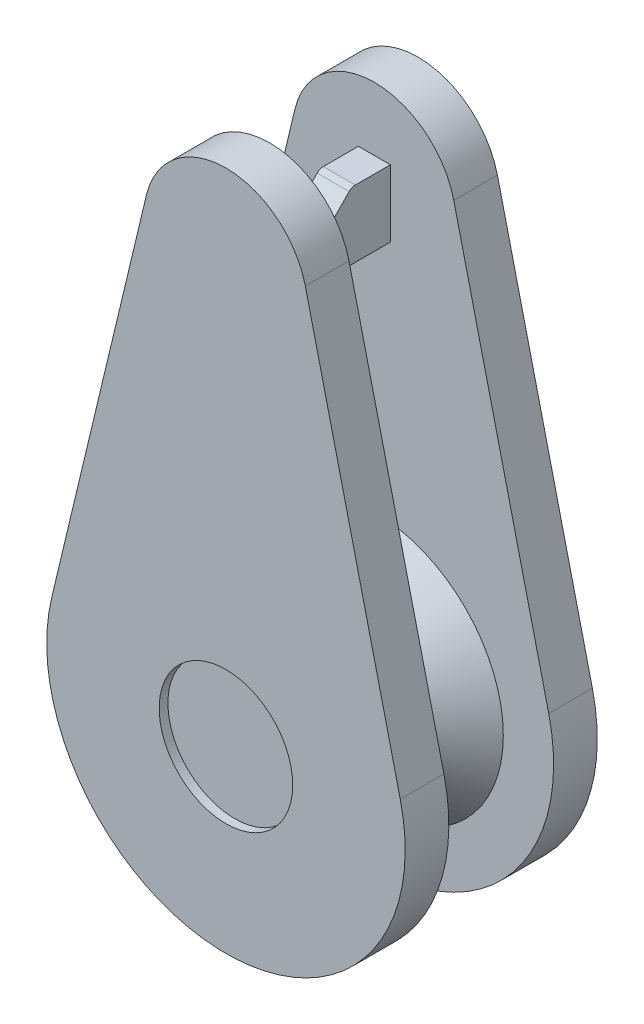
ISO-10303-21;
HEADER;
FILE_DESCRIPTION(('STEP AP214'),'2;1');
FILE_NAME('part.step','',(''),(''),'','','');
FILE_SCHEMA(('AUTOMOTIVE_DESIGN { 1 0 10303 214 1 1 1 1 }'));
ENDSEC;
DATA;
#1=APPLICATION_CONTEXT('core data for automotive mechanical design processes');
#2=APPLICATION_PROTOCOL_DEFINITION('international standard','automotive_design',2000,#1);
#3=PRODUCT_CONTEXT('',#1,'mechanical');
#4=PRODUCT('Part','Part','',(#3));
#5=PRODUCT_RELATED_PRODUCT_CATEGORY('part','',(#4));
#6=PRODUCT_DEFINITION_FORMATION('','',#4);
#7=PRODUCT_DEFINITION_CONTEXT('part definition',#1,'design');
#8=PRODUCT_DEFINITION('design','',#6,#7);
#9=PRODUCT_DEFINITION_SHAPE('','',#8);
#10=(LENGTH_UNIT() NAMED_UNIT(*) SI_UNIT(.MILLI.,.METRE.));
#11=(NAMED_UNIT(*) PLANE_ANGLE_UNIT() SI_UNIT($,.RADIAN.));
#12=(NAMED_UNIT(*) SI_UNIT($,.STERADIAN.) SOLID_ANGLE_UNIT());
#13=UNCERTAINTY_MEASURE_WITH_UNIT(LENGTH_MEASURE(1.E-05),#10,'distance_accuracy_value','');
#14=(GEOMETRIC_REPRESENTATION_CONTEXT(3) GLOBAL_UNCERTAINTY_ASSIGNED_CONTEXT((#13)) GLOBAL_UNIT_ASSIGNED_CONTEXT((#10,
#11,#12)) REPRESENTATION_CONTEXT('',''));
#15=CARTESIAN_POINT('',(0.,0.,0.));
#16=DIRECTION('',(0.,0.,1.));
#17=DIRECTION('',(1.,0.,0.));
#18=AXIS2_PLACEMENT_3D('',#15,#16,#17);
#19=CARTESIAN_POINT('',(24.5,136.000000000001,1.));
#20=DIRECTION('',(0.,0.,1.));
#21=DIRECTION('',(1.,0.,0.));
#22=AXIS2_PLACEMENT_3D('',#19,#20,#21);
#23=PLANE('',#22);
#24=CARTESIAN_POINT('',(24.5,136.000000000001,1.));
#25=DIRECTION('',(0.,0.,1.));
#26=DIRECTION('',(1.,0.,0.));
#27=AXIS2_PLACEMENT_3D('',#24,#25,#26);
#28=CIRCLE('',#27,4.10494291795747);
#29=CARTESIAN_POINT('',(20.5076953119614,136.955018134674,1.));
#30=VERTEX_POINT('',#29);
#31=CARTESIAN_POINT('',(28.4923043974712,136.955019349345,1.));
#32=VERTEX_POINT('',#31);
#33=EDGE_CURVE('E271',#30,#32,#28,.T.);
#34=ORIENTED_EDGE('',*,*,#33,.T.);
#35=DIRECTION('',(-0.232651066879886,0.972560271180995,0.));
#36=VECTOR('',#35,1.);
#37=CARTESIAN_POINT('',(26.3178255819127,146.045077413118,1.));
#38=LINE('',#37,#36);
#39=CARTESIAN_POINT('',(26.3178255819127,146.045077413118,1.));
#40=VERTEX_POINT('',#39);
#41=EDGE_CURVE('E274',#32,#40,#38,.T.);
#42=ORIENTED_EDGE('',*,*,#41,.T.);
#43=CARTESIAN_POINT('',(24.5,145.606873612069,1.));
#44=DIRECTION('',(0.,0.,1.));
#45=DIRECTION('',(-1.,0.,0.));
#46=AXIS2_PLACEMENT_3D('',#43,#44,#45);
#47=CIRCLE('',#46,1.86989636544635);
#48=CARTESIAN_POINT('',(22.681412951381,146.041906443135,1.));
#49=VERTEX_POINT('',#48);
#50=EDGE_CURVE('E277',#40,#49,#47,.T.);
#51=ORIENTED_EDGE('',*,*,#50,.T.);
#52=DIRECTION('',(-0.232650770975412,-0.972560341965755,0.));
#53=VECTOR('',#52,1.);
#54=CARTESIAN_POINT('',(20.5076953119614,136.955018134674,1.));
#55=LINE('',#54,#53);
#56=EDGE_CURVE('E279',#49,#30,#55,.T.);
#57=ORIENTED_EDGE('',*,*,#56,.T.);
#58=EDGE_LOOP('',(#34,#42,#51,#57));
#59=FACE_BOUND('',#58,.T.);
#60=CARTESIAN_POINT('',(24.5,136.000000000001,1.));
#61=DIRECTION('',(0.,0.,1.));
#62=DIRECTION('',(1.,0.,0.));
#63=AXIS2_PLACEMENT_3D('',#60,#61,#62);
#64=CIRCLE('',#63,2.95273846712997);
#65=CARTESIAN_POINT('',(27.45273846713,136.000000000001,1.));
#66=VERTEX_POINT('',#65);
#67=EDGE_CURVE('E267',#66,#66,#64,.T.);
#68=ORIENTED_EDGE('',*,*,#67,.F.);
#69=EDGE_LOOP('',(#68));
#70=FACE_BOUND('',#69,.T.);
#71=DIRECTION('',(-1.,0.,0.));
#72=VECTOR('',#71,1.);
#73=CARTESIAN_POINT('',(24.1333720619488,146.024420810161,1.));
#74=LINE('',#73,#72);
#75=CARTESIAN_POINT('',(24.8666279380512,146.024420810161,1.));
#76=VERTEX_POINT('',#75);
#77=CARTESIAN_POINT('',(24.1333720619488,146.024420810161,1.));
#78=VERTEX_POINT('',#77);
#79=EDGE_CURVE('E250',#76,#78,#74,.T.);
#80=ORIENTED_EDGE('',*,*,#79,.F.);
#81=DIRECTION('',(0.,1.,0.));
#82=VECTOR('',#81,1.);
#83=CARTESIAN_POINT('',(24.8666279380512,146.024420810161,1.));
#84=LINE('',#83,#82);
#85=CARTESIAN_POINT('',(24.8666279380512,144.490732446669,1.));
#86=VERTEX_POINT('',#85);
#87=EDGE_CURVE('E247',#86,#76,#84,.T.);
#88=ORIENTED_EDGE('',*,*,#87,.F.);
#89=DIRECTION('',(1.,0.,0.));
#90=VECTOR('',#89,1.);
#91=CARTESIAN_POINT('',(24.1333720619488,144.490732446669,1.));
#92=LINE('',#91,#90);
#93=CARTESIAN_POINT('',(24.1333720619488,144.490732446669,1.));
#94=VERTEX_POINT('',#93);
#95=EDGE_CURVE('E256',#94,#86,#92,.T.);
#96=ORIENTED_EDGE('',*,*,#95,.F.);
#97=DIRECTION('',(0.,-1.,0.));
#98=VECTOR('',#97,1.);
#99=CARTESIAN_POINT('',(24.1333720619488,146.024420810161,1.));
#100=LINE('',#99,#98);
#101=EDGE_CURVE('E253',#78,#94,#100,.T.);
#102=ORIENTED_EDGE('',*,*,#101,.F.);
#103=EDGE_LOOP('',(#80,#88,#96,#102));
#104=FACE_BOUND('',#103,.T.);
#105=ADVANCED_FACE('F40',(#59,#70,#104),#23,.T.);
#106=CARTESIAN_POINT('',(24.5,136.000000000001,1.));
#107=DIRECTION('',(0.,0.,-1.));
#108=DIRECTION('',(-1.,0.,0.));
#109=AXIS2_PLACEMENT_3D('',#106,#107,#108);
#110=CYLINDRICAL_SURFACE('',#109,4.10494291795747);
#111=CARTESIAN_POINT('',(24.5,136.000000000001,0.));
#112=DIRECTION('',(0.,0.,1.));
#113=DIRECTION('',(1.,0.,0.));
#114=AXIS2_PLACEMENT_3D('',#111,#112,#113);
#115=CIRCLE('',#114,4.10494291795747);
#116=CARTESIAN_POINT('',(20.5076953119614,136.955018134674,0.));
#117=VERTEX_POINT('',#116);
#118=CARTESIAN_POINT('',(28.4923043974712,136.955019349345,0.));
#119=VERTEX_POINT('',#118);
#120=EDGE_CURVE('E270',#117,#119,#115,.T.);
#121=ORIENTED_EDGE('',*,*,#120,.T.);
#122=DIRECTION('',(0.,0.,-1.));
#123=VECTOR('',#122,1.);
#124=CARTESIAN_POINT('',(28.4923043974712,136.955019349345,1.));
#125=LINE('',#124,#123);
#126=EDGE_CURVE('E297',#32,#119,#125,.T.);
#127=ORIENTED_EDGE('',*,*,#126,.F.);
#128=ORIENTED_EDGE('',*,*,#33,.F.);
#129=DIRECTION('',(0.,0.,-1.));
#130=VECTOR('',#129,1.);
#131=CARTESIAN_POINT('',(20.5076953119614,136.955018134674,1.));
#132=LINE('',#131,#130);
#133=EDGE_CURVE('E281',#30,#117,#132,.T.);
#134=ORIENTED_EDGE('',*,*,#133,.T.);
#135=EDGE_LOOP('',(#121,#127,#128,#134));
#136=FACE_BOUND('',#135,.T.);
#137=ADVANCED_FACE('F330',(#136),#110,.T.);
#138=CARTESIAN_POINT('',(26.3178255819127,146.045077413118,1.));
#139=DIRECTION('',(-0.972560271180995,-0.232651066879886,0.));
#140=DIRECTION('',(0.232651066879886,-0.972560271180995,0.));
#141=AXIS2_PLACEMENT_3D('',#138,#139,#140);
#142=PLANE('',#141);
#143=DIRECTION('',(-0.232651066879886,0.972560271180995,0.));
#144=VECTOR('',#143,1.);
#145=CARTESIAN_POINT('',(26.3178255819127,146.045077413118,0.));
#146=LINE('',#145,#144);
#147=CARTESIAN_POINT('',(26.3178255819127,146.045077413118,0.));
#148=VERTEX_POINT('',#147);
#149=EDGE_CURVE('E284',#119,#148,#146,.T.);
#150=ORIENTED_EDGE('',*,*,#149,.T.);
#151=DIRECTION('',(0.,0.,-1.));
#152=VECTOR('',#151,1.);
#153=CARTESIAN_POINT('',(26.3178255819127,146.045077413118,1.));
#154=LINE('',#153,#152);
#155=EDGE_CURVE('E294',#40,#148,#154,.T.);
#156=ORIENTED_EDGE('',*,*,#155,.F.);
#157=ORIENTED_EDGE('',*,*,#41,.F.);
#158=ORIENTED_EDGE('',*,*,#126,.T.);
#159=EDGE_LOOP('',(#150,#156,#157,#158));
#160=FACE_BOUND('',#159,.T.);
#161=ADVANCED_FACE('F336',(#160),#142,.F.);
#162=CARTESIAN_POINT('',(24.5,145.606873612069,1.));
#163=DIRECTION('',(0.,0.,-1.));
#164=DIRECTION('',(-1.,0.,0.));
#165=AXIS2_PLACEMENT_3D('',#162,#163,#164);
#166=CYLINDRICAL_SURFACE('',#165,1.86989636544635);
#167=CARTESIAN_POINT('',(24.5,145.606873612069,0.));
#168=DIRECTION('',(0.,0.,1.));
#169=DIRECTION('',(-1.,0.,0.));
#170=AXIS2_PLACEMENT_3D('',#167,#168,#169);
#171=CIRCLE('',#170,1.86989636544635);
#172=CARTESIAN_POINT('',(22.681412951381,146.041906443135,0.));
#173=VERTEX_POINT('',#172);
#174=EDGE_CURVE('E286',#148,#173,#171,.T.);
#175=ORIENTED_EDGE('',*,*,#174,.T.);
#176=DIRECTION('',(0.,0.,-1.));
#177=VECTOR('',#176,1.);
#178=CARTESIAN_POINT('',(22.681412951381,146.041906443135,1.));
#179=LINE('',#178,#177);
#180=EDGE_CURVE('E291',#49,#173,#179,.T.);
#181=ORIENTED_EDGE('',*,*,#180,.F.);
#182=ORIENTED_EDGE('',*,*,#50,.F.);
#183=ORIENTED_EDGE('',*,*,#155,.T.);
#184=EDGE_LOOP('',(#175,#181,#182,#183));
#185=FACE_BOUND('',#184,.T.);
#186=ADVANCED_FACE('F350',(#185),#166,.T.);
#187=CARTESIAN_POINT('',(20.5076953119614,136.955018134674,1.));
#188=DIRECTION('',(0.972560341965755,-0.232650770975412,0.));
#189=DIRECTION('',(0.232650770975412,0.972560341965755,0.));
#190=AXIS2_PLACEMENT_3D('',#187,#188,#189);
#191=PLANE('',#190);
#192=DIRECTION('',(-0.232650770975412,-0.972560341965755,0.));
#193=VECTOR('',#192,1.);
#194=CARTESIAN_POINT('',(20.5076953119614,136.955018134674,0.));
#195=LINE('',#194,#193);
#196=EDGE_CURVE('E275',#173,#117,#195,.T.);
#197=ORIENTED_EDGE('',*,*,#196,.T.);
#198=ORIENTED_EDGE('',*,*,#133,.F.);
#199=ORIENTED_EDGE('',*,*,#56,.F.);
#200=ORIENTED_EDGE('',*,*,#180,.T.);
#201=EDGE_LOOP('',(#197,#198,#199,#200));
#202=FACE_BOUND('',#201,.T.);
#203=ADVANCED_FACE('F346',(#202),#191,.F.);
#204=CARTESIAN_POINT('',(24.5,136.000000000001,0.));
#205=DIRECTION('',(0.,0.,1.));
#206=DIRECTION('',(1.,0.,0.));
#207=AXIS2_PLACEMENT_3D('',#204,#205,#206);
#208=PLANE('',#207);
#209=ORIENTED_EDGE('',*,*,#120,.F.);
#210=ORIENTED_EDGE('',*,*,#196,.F.);
#211=ORIENTED_EDGE('',*,*,#174,.F.);
#212=ORIENTED_EDGE('',*,*,#149,.F.);
#213=EDGE_LOOP('',(#209,#210,#211,#212));
#214=FACE_BOUND('',#213,.T.);
#215=ADVANCED_FACE('F343',(#214),#208,.F.);
#216=CARTESIAN_POINT('',(24.5,136.000000000001,2.2));
#217=DIRECTION('',(0.,0.,-1.));
#218=DIRECTION('',(-1.,0.,0.));
#219=AXIS2_PLACEMENT_3D('',#216,#217,#218);
#220=CONICAL_SURFACE('',#219,1.73815260557396,0.791438820048917);
#221=CARTESIAN_POINT('',(24.5,136.000000000001,2.05772695129359));
#222=DIRECTION('',(0.,0.,-1.));
#223=DIRECTION('',(-1.,0.,0.));
#224=AXIS2_PLACEMENT_3D('',#221,#222,#223);
#225=CIRCLE('',#224,1.88215496677335);
#226=CARTESIAN_POINT('',(22.6178450332266,136.000000000001,2.05772695129359));
#227=VERTEX_POINT('',#226);
#228=EDGE_CURVE('E48',#227,#227,#225,.T.);
#229=ORIENTED_EDGE('',*,*,#228,.T.);
#230=EDGE_LOOP('',(#229));
#231=FACE_BOUND('',#230,.T.);
#232=ORIENTED_EDGE('',*,*,#67,.T.);
#233=EDGE_LOOP('',(#232));
#234=FACE_BOUND('',#233,.T.);
#235=ADVANCED_FACE('F318',(#231,#234),#220,.T.);
#236=CARTESIAN_POINT('',(24.8666279380512,146.024420810161,3.4));
#237=DIRECTION('',(-1.,0.,0.));
#238=DIRECTION('',(0.,0.,1.));
#239=AXIS2_PLACEMENT_3D('',#236,#237,#238);
#240=PLANE('',#239);
#241=DIRECTION('',(0.,0.,-1.));
#242=VECTOR('',#241,1.);
#243=CARTESIAN_POINT('',(24.8666279380512,146.024420810161,3.4));
#244=LINE('',#243,#242);
#245=CARTESIAN_POINT('',(24.8666279380512,146.024420810161,1.80116368583087));
#246=VERTEX_POINT('',#245);
#247=EDGE_CURVE('E265',#246,#76,#244,.T.);
#248=ORIENTED_EDGE('',*,*,#247,.F.);
#249=CARTESIAN_POINT('',(24.8666279380512,145.824420810161,1.80116368583087));
#250=DIRECTION('',(-1.,0.,0.));
#251=DIRECTION('',(0.,0.,1.));
#252=AXIS2_PLACEMENT_3D('',#249,#250,#251);
#253=CIRCLE('',#252,0.2);
#254=CARTESIAN_POINT('',(24.8666279380512,145.964986025553,1.94343603107641));
#255=VERTEX_POINT('',#254);
#256=EDGE_CURVE('E312',#246,#255,#253,.F.);
#257=ORIENTED_EDGE('',*,*,#256,.T.);
#258=DIRECTION('',(0.,-0.711361726227743,0.702826076962349));
#259=VECTOR('',#258,1.);
#260=CARTESIAN_POINT('',(24.8666279380512,145.266833213032,2.63321168845735));
#261=LINE('',#260,#259);
#262=CARTESIAN_POINT('',(24.8666279380512,144.831297662062,3.0635212361601));
#263=VERTEX_POINT('',#262);
#264=EDGE_CURVE('E245',#255,#263,#261,.T.);
#265=ORIENTED_EDGE('',*,*,#264,.T.);
#266=CARTESIAN_POINT('',(24.8666279380512,144.690732446669,2.92124889091455));
#267=DIRECTION('',(-1.,0.,0.));
#268=DIRECTION('',(0.,0.,1.));
#269=AXIS2_PLACEMENT_3D('',#266,#267,#268);
#270=CIRCLE('',#269,0.2);
#271=CARTESIAN_POINT('',(24.8666279380512,144.490732446669,2.92124889091455));
#272=VERTEX_POINT('',#271);
#273=EDGE_CURVE('E55',#263,#272,#270,.F.);
#274=ORIENTED_EDGE('',*,*,#273,.T.);
#275=DIRECTION('',(0.,0.,-1.));
#276=VECTOR('',#275,1.);
#277=CARTESIAN_POINT('',(24.8666279380512,144.490732446669,3.4));
#278=LINE('',#277,#276);
#279=EDGE_CURVE('E259',#272,#86,#278,.T.);
#280=ORIENTED_EDGE('',*,*,#279,.T.);
#281=ORIENTED_EDGE('',*,*,#87,.T.);
#282=EDGE_LOOP('',(#248,#257,#265,#274,#280,#281));
#283=FACE_BOUND('',#282,.T.);
#284=ADVANCED_FACE('F384',(#283),#240,.F.);
#285=CARTESIAN_POINT('',(24.1333720619488,146.024420810161,3.4));
#286=DIRECTION('',(0.,-1.,0.));
#287=DIRECTION('',(0.,0.,-1.));
#288=AXIS2_PLACEMENT_3D('',#285,#286,#287);
#289=PLANE('',#288);
#290=DIRECTION('',(0.,0.,-1.));
#291=VECTOR('',#290,1.);
#292=CARTESIAN_POINT('',(24.1333720619488,146.024420810161,3.4));
#293=LINE('',#292,#291);
#294=CARTESIAN_POINT('',(24.1333720619488,146.024420810161,1.80116368583087));
#295=VERTEX_POINT('',#294);
#296=EDGE_CURVE('E263',#295,#78,#293,.T.);
#297=ORIENTED_EDGE('',*,*,#296,.F.);
#298=DIRECTION('',(-1.,0.,0.));
#299=VECTOR('',#298,1.);
#300=CARTESIAN_POINT('',(24.1333720619488,146.024420810161,1.80116368583087));
#301=LINE('',#300,#299);
#302=EDGE_CURVE('E63',#295,#246,#301,.F.);
#303=ORIENTED_EDGE('',*,*,#302,.T.);
#304=ORIENTED_EDGE('',*,*,#247,.T.);
#305=ORIENTED_EDGE('',*,*,#79,.T.);
#306=EDGE_LOOP('',(#297,#303,#304,#305));
#307=FACE_BOUND('',#306,.T.);
#308=ADVANCED_FACE('F376',(#307),#289,.F.);
#309=CARTESIAN_POINT('',(24.1333720619488,146.024420810161,3.4));
#310=DIRECTION('',(1.,0.,0.));
#311=DIRECTION('',(0.,0.,-1.));
#312=AXIS2_PLACEMENT_3D('',#309,#310,#311);
#313=PLANE('',#312);
#314=DIRECTION('',(0.,-0.711361726227743,0.702826076962349));
#315=VECTOR('',#314,1.);
#316=CARTESIAN_POINT('',(24.1333720619488,146.024420810161,1.88471440611308));
#317=LINE('',#316,#315);
#318=CARTESIAN_POINT('',(24.1333720619488,145.964986025553,1.94343603107642));
#319=VERTEX_POINT('',#318);
#320=CARTESIAN_POINT('',(24.1333720619488,144.831297662062,3.0635212361601));
#321=VERTEX_POINT('',#320);
#322=EDGE_CURVE('E240',#319,#321,#317,.T.);
#323=ORIENTED_EDGE('',*,*,#322,.F.);
#324=CARTESIAN_POINT('',(24.1333720619488,145.824420810161,1.80116368583087));
#325=DIRECTION('',(1.,0.,0.));
#326=DIRECTION('',(0.,0.,-1.));
#327=AXIS2_PLACEMENT_3D('',#324,#325,#326);
#328=CIRCLE('',#327,0.2);
#329=EDGE_CURVE('E308',#319,#295,#328,.F.);
#330=ORIENTED_EDGE('',*,*,#329,.T.);
#331=ORIENTED_EDGE('',*,*,#296,.T.);
#332=ORIENTED_EDGE('',*,*,#101,.T.);
#333=DIRECTION('',(0.,0.,-1.));
#334=VECTOR('',#333,1.);
#335=CARTESIAN_POINT('',(24.1333720619488,144.490732446669,3.4));
#336=LINE('',#335,#334);
#337=CARTESIAN_POINT('',(24.1333720619488,144.490732446669,2.92124889091455));
#338=VERTEX_POINT('',#337);
#339=EDGE_CURVE('E261',#338,#94,#336,.T.);
#340=ORIENTED_EDGE('',*,*,#339,.F.);
#341=CARTESIAN_POINT('',(24.1333720619488,144.690732446669,2.92124889091455));
#342=DIRECTION('',(1.,0.,0.));
#343=DIRECTION('',(0.,0.,-1.));
#344=AXIS2_PLACEMENT_3D('',#341,#342,#343);
#345=CIRCLE('',#344,0.2);
#346=EDGE_CURVE('E306',#338,#321,#345,.F.);
#347=ORIENTED_EDGE('',*,*,#346,.T.);
#348=EDGE_LOOP('',(#323,#330,#331,#332,#340,#347));
#349=FACE_BOUND('',#348,.T.);
#350=ADVANCED_FACE('F371',(#349),#313,.F.);
#351=CARTESIAN_POINT('',(24.1333720619488,144.490732446669,3.4));
#352=DIRECTION('',(0.,1.,0.));
#353=DIRECTION('',(0.,0.,1.));
#354=AXIS2_PLACEMENT_3D('',#351,#352,#353);
#355=PLANE('',#354);
#356=ORIENTED_EDGE('',*,*,#279,.F.);
#357=DIRECTION('',(1.,0.,0.));
#358=VECTOR('',#357,1.);
#359=CARTESIAN_POINT('',(24.1333720619488,144.490732446669,2.92124889091455));
#360=LINE('',#359,#358);
#361=EDGE_CURVE('E314',#272,#338,#360,.F.);
#362=ORIENTED_EDGE('',*,*,#361,.T.);
#363=ORIENTED_EDGE('',*,*,#339,.T.);
#364=ORIENTED_EDGE('',*,*,#95,.T.);
#365=EDGE_LOOP('',(#356,#362,#363,#364));
#366=FACE_BOUND('',#365,.T.);
#367=ADVANCED_FACE('F383',(#366),#355,.F.);
#368=CARTESIAN_POINT('',(26.5333720619488,146.024420810161,1.88471440611308));
#369=DIRECTION('',(0.,-0.702826076962349,-0.711361726227743));
#370=DIRECTION('',(0.,0.711361726227743,-0.702826076962349));
#371=AXIS2_PLACEMENT_3D('',#368,#369,#370);
#372=PLANE('',#371);
#373=ORIENTED_EDGE('',*,*,#264,.F.);
#374=DIRECTION('',(-1.,0.,0.));
#375=VECTOR('',#374,1.);
#376=CARTESIAN_POINT('',(26.5333720619488,145.964986025553,1.94343603107642));
#377=LINE('',#376,#375);
#378=EDGE_CURVE('E303',#255,#319,#377,.T.);
#379=ORIENTED_EDGE('',*,*,#378,.T.);
#380=ORIENTED_EDGE('',*,*,#322,.T.);
#381=DIRECTION('',(1.,0.,0.));
#382=VECTOR('',#381,1.);
#383=CARTESIAN_POINT('',(26.5333720619488,144.831297662062,3.0635212361601));
#384=LINE('',#383,#382);
#385=EDGE_CURVE('E300',#321,#263,#384,.T.);
#386=ORIENTED_EDGE('',*,*,#385,.T.);
#387=EDGE_LOOP('',(#373,#379,#380,#386));
#388=FACE_BOUND('',#387,.T.);
#389=ADVANCED_FACE('F229',(#388),#372,.F.);
#390=CARTESIAN_POINT('',(26.5333720619488,145.824420810161,1.80116368583087));
#391=DIRECTION('',(-1.,0.,0.));
#392=DIRECTION('',(0.,0.,1.));
#393=AXIS2_PLACEMENT_3D('',#390,#391,#392);
#394=CYLINDRICAL_SURFACE('',#393,0.2);
#395=ORIENTED_EDGE('',*,*,#256,.F.);
#396=ORIENTED_EDGE('',*,*,#302,.F.);
#397=ORIENTED_EDGE('',*,*,#329,.F.);
#398=ORIENTED_EDGE('',*,*,#378,.F.);
#399=EDGE_LOOP('',(#395,#396,#397,#398));
#400=FACE_BOUND('',#399,.T.);
#401=ADVANCED_FACE('F358',(#400),#394,.T.);
#402=CARTESIAN_POINT('',(26.5333720619488,144.690732446669,2.92124889091455));
#403=DIRECTION('',(1.,0.,0.));
#404=DIRECTION('',(0.,0.,-1.));
#405=AXIS2_PLACEMENT_3D('',#402,#403,#404);
#406=CYLINDRICAL_SURFACE('',#405,0.2);
#407=ORIENTED_EDGE('',*,*,#346,.F.);
#408=ORIENTED_EDGE('',*,*,#361,.F.);
#409=ORIENTED_EDGE('',*,*,#273,.F.);
#410=ORIENTED_EDGE('',*,*,#385,.F.);
#411=EDGE_LOOP('',(#407,#408,#409,#410));
#412=FACE_BOUND('',#411,.T.);
#413=ADVANCED_FACE('F227',(#412),#406,.T.);
#414=CARTESIAN_POINT('',(24.5,136.000000000001,2.2));
#415=DIRECTION('',(0.,0.,1.));
#416=DIRECTION('',(-1.,0.,0.));
#417=AXIS2_PLACEMENT_3D('',#414,#415,#416);
#418=CONICAL_SURFACE('',#417,1.73815260557396,0.791438820048917);
#419=CARTESIAN_POINT('',(24.5,136.000000000001,2.34227304870641));
#420=DIRECTION('',(0.,0.,1.));
#421=DIRECTION('',(1.,0.,0.));
#422=AXIS2_PLACEMENT_3D('',#419,#420,#421);
#423=CIRCLE('',#422,1.88215496677335);
#424=CARTESIAN_POINT('',(26.3821549667733,136.000000000001,2.34227304870641));
#425=VERTEX_POINT('',#424);
#426=EDGE_CURVE('E12',#425,#425,#423,.T.);
#427=ORIENTED_EDGE('',*,*,#426,.T.);
#428=EDGE_LOOP('',(#427));
#429=FACE_BOUND('',#428,.T.);
#430=CARTESIAN_POINT('',(24.5,136.000000000001,3.4));
#431=DIRECTION('',(0.,0.,1.));
#432=DIRECTION('',(1.,0.,0.));
#433=AXIS2_PLACEMENT_3D('',#430,#431,#432);
#434=CIRCLE('',#433,2.95273846712997);
#435=CARTESIAN_POINT('',(27.45273846713,136.000000000001,3.4));
#436=VERTEX_POINT('',#435);
#437=EDGE_CURVE('E153',#436,#436,#434,.T.);
#438=ORIENTED_EDGE('',*,*,#437,.F.);
#439=EDGE_LOOP('',(#438));
#440=FACE_BOUND('',#439,.T.);
#441=ADVANCED_FACE('F223',(#429,#440),#418,.T.);
#442=CARTESIAN_POINT('',(24.5,136.000000000001,3.4));
#443=DIRECTION('',(0.,0.,1.));
#444=DIRECTION('',(1.,0.,0.));
#445=AXIS2_PLACEMENT_3D('',#442,#443,#444);
#446=CYLINDRICAL_SURFACE('',#445,4.10494291795747);
#447=CARTESIAN_POINT('',(24.5,136.000000000001,4.4));
#448=DIRECTION('',(0.,0.,1.));
#449=DIRECTION('',(1.,0.,0.));
#450=AXIS2_PLACEMENT_3D('',#447,#448,#449);
#451=CIRCLE('',#450,4.10494291795747);
#452=CARTESIAN_POINT('',(20.5076953119614,136.955018134674,4.4));
#453=VERTEX_POINT('',#452);
#454=CARTESIAN_POINT('',(28.4923043974712,136.955019349345,4.4));
#455=VERTEX_POINT('',#454);
#456=EDGE_CURVE('E148',#453,#455,#451,.T.);
#457=ORIENTED_EDGE('',*,*,#456,.F.);
#458=DIRECTION('',(0.,0.,1.));
#459=VECTOR('',#458,1.);
#460=CARTESIAN_POINT('',(20.5076953119614,136.955018134674,3.4));
#461=LINE('',#460,#459);
#462=CARTESIAN_POINT('',(20.5076953119614,136.955018134674,3.4));
#463=VERTEX_POINT('',#462);
#464=EDGE_CURVE('E142',#463,#453,#461,.T.);
#465=ORIENTED_EDGE('',*,*,#464,.F.);
#466=CARTESIAN_POINT('',(24.5,136.000000000001,3.4));
#467=DIRECTION('',(0.,0.,1.));
#468=DIRECTION('',(1.,0.,0.));
#469=AXIS2_PLACEMENT_3D('',#466,#467,#468);
#470=CIRCLE('',#469,4.10494291795747);
#471=CARTESIAN_POINT('',(28.4923043974712,136.955019349345,3.4));
#472=VERTEX_POINT('',#471);
#473=EDGE_CURVE('E145',#463,#472,#470,.T.);
#474=ORIENTED_EDGE('',*,*,#473,.T.);
#475=DIRECTION('',(0.,0.,1.));
#476=VECTOR('',#475,1.);
#477=CARTESIAN_POINT('',(28.4923043974712,136.955019349345,3.4));
#478=LINE('',#477,#476);
#479=EDGE_CURVE('E173',#472,#455,#478,.T.);
#480=ORIENTED_EDGE('',*,*,#479,.T.);
#481=EDGE_LOOP('',(#457,#465,#474,#480));
#482=FACE_BOUND('',#481,.T.);
#483=ADVANCED_FACE('F144',(#482),#446,.T.);
#484=CARTESIAN_POINT('',(20.5076953119614,136.955018134674,3.4));
#485=DIRECTION('',(-0.972560341965755,0.232650770975412,0.));
#486=DIRECTION('',(-0.232650770975412,-0.972560341965755,0.));
#487=AXIS2_PLACEMENT_3D('',#484,#485,#486);
#488=PLANE('',#487);
#489=DIRECTION('',(-0.232650770975412,-0.972560341965755,0.));
#490=VECTOR('',#489,1.);
#491=CARTESIAN_POINT('',(20.5076953119614,136.955018134674,4.4));
#492=LINE('',#491,#490);
#493=CARTESIAN_POINT('',(22.681412951381,146.041906443135,4.4));
#494=VERTEX_POINT('',#493);
#495=EDGE_CURVE('E175',#494,#453,#492,.T.);
#496=ORIENTED_EDGE('',*,*,#495,.F.);
#497=DIRECTION('',(0.,0.,1.));
#498=VECTOR('',#497,1.);
#499=CARTESIAN_POINT('',(22.681412951381,146.041906443135,3.4));
#500=LINE('',#499,#498);
#501=CARTESIAN_POINT('',(22.681412951381,146.041906443135,3.4));
#502=VERTEX_POINT('',#501);
#503=EDGE_CURVE('E154',#502,#494,#500,.T.);
#504=ORIENTED_EDGE('',*,*,#503,.F.);
#505=DIRECTION('',(-0.232650770975412,-0.972560341965755,0.));
#506=VECTOR('',#505,1.);
#507=CARTESIAN_POINT('',(20.5076953119614,136.955018134674,3.4));
#508=LINE('',#507,#506);
#509=EDGE_CURVE('E160',#502,#463,#508,.T.);
#510=ORIENTED_EDGE('',*,*,#509,.T.);
#511=ORIENTED_EDGE('',*,*,#464,.T.);
#512=EDGE_LOOP('',(#496,#504,#510,#511));
#513=FACE_BOUND('',#512,.T.);
#514=ADVANCED_FACE('F166',(#513),#488,.T.);
#515=CARTESIAN_POINT('',(24.5,145.606873612069,3.4));
#516=DIRECTION('',(0.,0.,1.));
#517=DIRECTION('',(1.,0.,0.));
#518=AXIS2_PLACEMENT_3D('',#515,#516,#517);
#519=CYLINDRICAL_SURFACE('',#518,1.86989636544635);
#520=CARTESIAN_POINT('',(24.5,145.606873612069,4.4));
#521=DIRECTION('',(0.,0.,1.));
#522=DIRECTION('',(-1.,0.,0.));
#523=AXIS2_PLACEMENT_3D('',#520,#521,#522);
#524=CIRCLE('',#523,1.86989636544635);
#525=CARTESIAN_POINT('',(26.3178255819127,146.045077413118,4.4));
#526=VERTEX_POINT('',#525);
#527=EDGE_CURVE('E178',#526,#494,#524,.T.);
#528=ORIENTED_EDGE('',*,*,#527,.F.);
#529=DIRECTION('',(0.,0.,1.));
#530=VECTOR('',#529,1.);
#531=CARTESIAN_POINT('',(26.3178255819127,146.045077413118,3.4));
#532=LINE('',#531,#530);
#533=CARTESIAN_POINT('',(26.3178255819127,146.045077413118,3.4));
#534=VERTEX_POINT('',#533);
#535=EDGE_CURVE('E184',#534,#526,#532,.T.);
#536=ORIENTED_EDGE('',*,*,#535,.F.);
#537=CARTESIAN_POINT('',(24.5,145.606873612069,3.4));
#538=DIRECTION('',(0.,0.,1.));
#539=DIRECTION('',(-1.,0.,0.));
#540=AXIS2_PLACEMENT_3D('',#537,#538,#539);
#541=CIRCLE('',#540,1.86989636544635);
#542=EDGE_CURVE('E167',#534,#502,#541,.T.);
#543=ORIENTED_EDGE('',*,*,#542,.T.);
#544=ORIENTED_EDGE('',*,*,#503,.T.);
#545=EDGE_LOOP('',(#528,#536,#543,#544));
#546=FACE_BOUND('',#545,.T.);
#547=ADVANCED_FACE('F214',(#546),#519,.T.);
#548=CARTESIAN_POINT('',(26.3178255819127,146.045077413118,3.4));
#549=DIRECTION('',(0.972560271180995,0.232651066879886,0.));
#550=DIRECTION('',(-0.232651066879886,0.972560271180995,0.));
#551=AXIS2_PLACEMENT_3D('',#548,#549,#550);
#552=PLANE('',#551);
#553=DIRECTION('',(-0.232651066879886,0.972560271180995,0.));
#554=VECTOR('',#553,1.);
#555=CARTESIAN_POINT('',(26.3178255819127,146.045077413118,4.4));
#556=LINE('',#555,#554);
#557=EDGE_CURVE('E164',#455,#526,#556,.T.);
#558=ORIENTED_EDGE('',*,*,#557,.F.);
#559=ORIENTED_EDGE('',*,*,#479,.F.);
#560=DIRECTION('',(-0.232651066879886,0.972560271180995,0.));
#561=VECTOR('',#560,1.);
#562=CARTESIAN_POINT('',(26.3178255819127,146.045077413118,3.4));
#563=LINE('',#562,#561);
#564=EDGE_CURVE('E163',#472,#534,#563,.T.);
#565=ORIENTED_EDGE('',*,*,#564,.T.);
#566=ORIENTED_EDGE('',*,*,#535,.T.);
#567=EDGE_LOOP('',(#558,#559,#565,#566));
#568=FACE_BOUND('',#567,.T.);
#569=ADVANCED_FACE('F206',(#568),#552,.T.);
#570=CARTESIAN_POINT('',(24.5,136.000000000001,3.4));
#571=DIRECTION('',(0.,0.,-1.));
#572=DIRECTION('',(1.,0.,0.));
#573=AXIS2_PLACEMENT_3D('',#570,#571,#572);
#574=PLANE('',#573);
#575=ORIENTED_EDGE('',*,*,#437,.T.);
#576=EDGE_LOOP('',(#575));
#577=FACE_BOUND('',#576,.T.);
#578=ORIENTED_EDGE('',*,*,#473,.F.);
#579=ORIENTED_EDGE('',*,*,#509,.F.);
#580=ORIENTED_EDGE('',*,*,#542,.F.);
#581=ORIENTED_EDGE('',*,*,#564,.F.);
#582=EDGE_LOOP('',(#578,#579,#580,#581));
#583=FACE_BOUND('',#582,.T.);
#584=ADVANCED_FACE('F158',(#577,#583),#574,.T.);
#585=CARTESIAN_POINT('',(24.5,136.000000000001,4.4));
#586=DIRECTION('',(0.,0.,-1.));
#587=DIRECTION('',(1.,0.,0.));
#588=AXIS2_PLACEMENT_3D('',#585,#586,#587);
#589=PLANE('',#588);
#590=CARTESIAN_POINT('',(24.5,136.000000000001,4.4));
#591=DIRECTION('',(0.,0.,1.));
#592=DIRECTION('',(1.,0.,0.));
#593=AXIS2_PLACEMENT_3D('',#590,#591,#592);
#594=CIRCLE('',#593,1.52935701608279);
#595=CARTESIAN_POINT('',(26.0293570160828,136.000000000001,4.4));
#596=VERTEX_POINT('',#595);
#597=EDGE_CURVE('E481',#596,#596,#594,.T.);
#598=ORIENTED_EDGE('',*,*,#597,.F.);
#599=EDGE_LOOP('',(#598));
#600=FACE_BOUND('',#599,.T.);
#601=ORIENTED_EDGE('',*,*,#456,.T.);
#602=ORIENTED_EDGE('',*,*,#557,.T.);
#603=ORIENTED_EDGE('',*,*,#527,.T.);
#604=ORIENTED_EDGE('',*,*,#495,.T.);
#605=EDGE_LOOP('',(#601,#602,#603,#604));
#606=FACE_BOUND('',#605,.T.);
#607=ADVANCED_FACE('F205',(#600,#606),#589,.F.);
#608=CARTESIAN_POINT('',(24.5,136.000000000001,2.2));
#609=DIRECTION('',(0.,0.,-1.));
#610=DIRECTION('',(-1.,0.,0.));
#611=AXIS2_PLACEMENT_3D('',#608,#609,#610);
#612=TOROIDAL_SURFACE('',#611,2.02271947015804,0.2);
#613=ORIENTED_EDGE('',*,*,#426,.F.);
#614=EDGE_LOOP('',(#613));
#615=FACE_BOUND('',#614,.T.);
#616=ORIENTED_EDGE('',*,*,#228,.F.);
#617=EDGE_LOOP('',(#616));
#618=FACE_BOUND('',#617,.T.);
#619=ADVANCED_FACE('F42',(#615,#618),#612,.F.);
#620=CARTESIAN_POINT('',(24.5,136.000000000001,4.2));
#621=DIRECTION('',(0.,0.,1.));
#622=DIRECTION('',(1.,0.,0.));
#623=AXIS2_PLACEMENT_3D('',#620,#621,#622);
#624=CYLINDRICAL_SURFACE('',#623,1.52935701608279);
#625=CARTESIAN_POINT('',(24.5,136.000000000001,4.2));
#626=DIRECTION('',(0.,0.,1.));
#627=DIRECTION('',(1.,0.,0.));
#628=AXIS2_PLACEMENT_3D('',#625,#626,#627);
#629=CIRCLE('',#628,1.52935701608279);
#630=CARTESIAN_POINT('',(26.0293570160828,136.000000000001,4.2));
#631=VERTEX_POINT('',#630);
#632=EDGE_CURVE('E176',#631,#631,#629,.T.);
#633=ORIENTED_EDGE('',*,*,#632,.F.);
#634=EDGE_LOOP('',(#633));
#635=FACE_BOUND('',#634,.T.);
#636=ORIENTED_EDGE('',*,*,#597,.T.);
#637=EDGE_LOOP('',(#636));
#638=FACE_BOUND('',#637,.T.);
#639=ADVANCED_FACE('F207',(#635,#638),#624,.F.);
#640=CARTESIAN_POINT('',(24.5,136.000000000001,4.2));
#641=DIRECTION('',(0.,0.,1.));
#642=DIRECTION('',(1.,0.,0.));
#643=AXIS2_PLACEMENT_3D('',#640,#641,#642);
#644=PLANE('',#643);
#645=ORIENTED_EDGE('',*,*,#632,.T.);
#646=EDGE_LOOP('',(#645));
#647=FACE_BOUND('',#646,.T.);
#648=ADVANCED_FACE('F326',(#647),#644,.T.);
#649=CLOSED_SHELL('',(#105,#137,#161,#186,#203,#215,#235,#284,#308,#350,#367,#389,#401,#413,
#441,#483,#514,#547,#569,#584,#607,#619,#639,#648));
#650=MANIFOLD_SOLID_BREP('B2',#649);
#651=ADVANCED_BREP_SHAPE_REPRESENTATION('',(#18,#650),#14);
#652=SHAPE_DEFINITION_REPRESENTATION(#9,#651);
ENDSEC;
END-ISO-10303-21;
